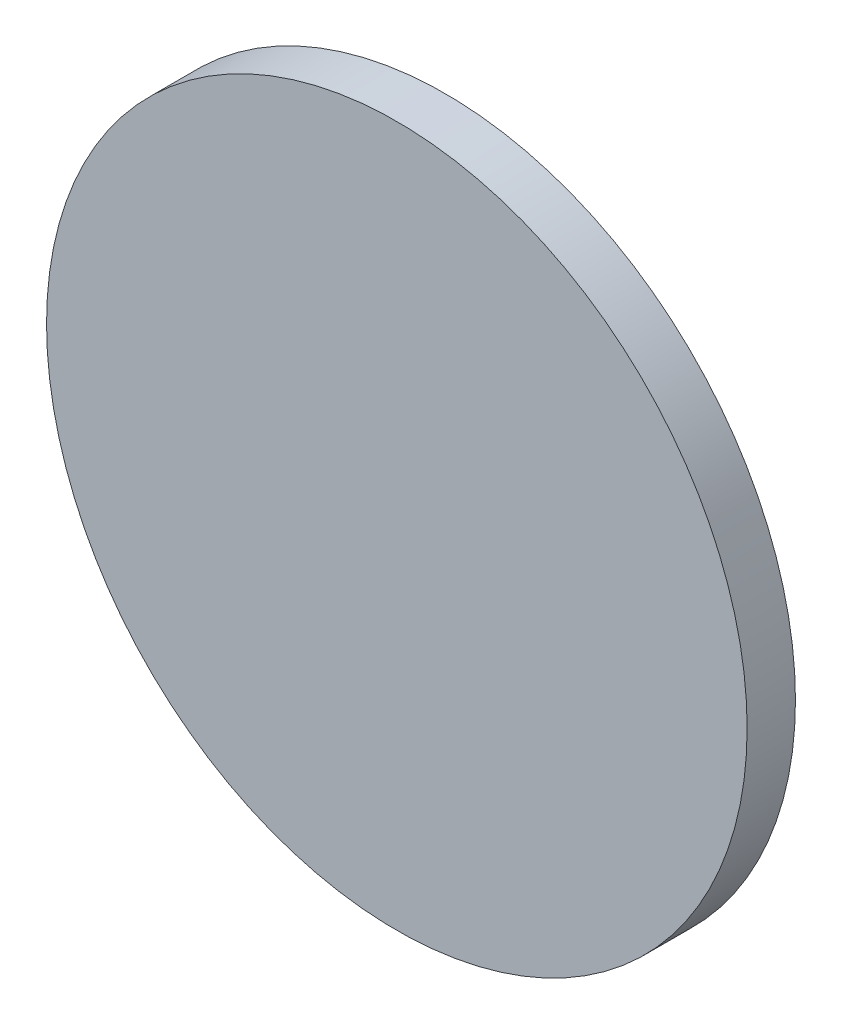
ISO-10303-21;
HEADER;
FILE_DESCRIPTION(('STEP AP214'),'2;1');
FILE_NAME('part.step','',(''),(''),'','','');
FILE_SCHEMA(('AUTOMOTIVE_DESIGN { 1 0 10303 214 1 1 1 1 }'));
ENDSEC;
DATA;
#1=APPLICATION_CONTEXT('core data for automotive mechanical design processes');
#2=APPLICATION_PROTOCOL_DEFINITION('international standard','automotive_design',2000,#1);
#3=PRODUCT_CONTEXT('',#1,'mechanical');
#4=PRODUCT('Part','Part','',(#3));
#5=PRODUCT_RELATED_PRODUCT_CATEGORY('part','',(#4));
#6=PRODUCT_DEFINITION_FORMATION('','',#4);
#7=PRODUCT_DEFINITION_CONTEXT('part definition',#1,'design');
#8=PRODUCT_DEFINITION('design','',#6,#7);
#9=PRODUCT_DEFINITION_SHAPE('','',#8);
#10=(LENGTH_UNIT() NAMED_UNIT(*) SI_UNIT(.MILLI.,.METRE.));
#11=(NAMED_UNIT(*) PLANE_ANGLE_UNIT() SI_UNIT($,.RADIAN.));
#12=(NAMED_UNIT(*) SI_UNIT($,.STERADIAN.) SOLID_ANGLE_UNIT());
#13=UNCERTAINTY_MEASURE_WITH_UNIT(LENGTH_MEASURE(1.E-05),#10,'distance_accuracy_value','');
#14=(GEOMETRIC_REPRESENTATION_CONTEXT(3) GLOBAL_UNCERTAINTY_ASSIGNED_CONTEXT((#13)) GLOBAL_UNIT_ASSIGNED_CONTEXT((#10,
#11,#12)) REPRESENTATION_CONTEXT('',''));
#15=CARTESIAN_POINT('',(0.,0.,0.));
#16=DIRECTION('',(0.,0.,1.));
#17=DIRECTION('',(1.,0.,0.));
#18=AXIS2_PLACEMENT_3D('',#15,#16,#17);
#19=CARTESIAN_POINT('',(0.,0.,2.));
#20=DIRECTION('',(0.,0.,-1.));
#21=DIRECTION('',(-1.,0.,0.));
#22=AXIS2_PLACEMENT_3D('',#19,#20,#21);
#23=CYLINDRICAL_SURFACE('',#22,14.5);
#24=CARTESIAN_POINT('',(0.,0.,2.));
#25=DIRECTION('',(0.,0.,1.));
#26=DIRECTION('',(1.,0.,0.));
#27=AXIS2_PLACEMENT_3D('',#24,#25,#26);
#28=CIRCLE('',#27,14.5);
#29=CARTESIAN_POINT('',(14.5,0.,2.));
#30=VERTEX_POINT('',#29);
#31=EDGE_CURVE('E10',#30,#30,#28,.T.);
#32=ORIENTED_EDGE('',*,*,#31,.F.);
#33=EDGE_LOOP('',(#32));
#34=FACE_BOUND('',#33,.T.);
#35=CARTESIAN_POINT('',(0.,0.,0.));
#36=DIRECTION('',(0.,0.,1.));
#37=DIRECTION('',(1.,0.,0.));
#38=AXIS2_PLACEMENT_3D('',#35,#36,#37);
#39=CIRCLE('',#38,14.5);
#40=CARTESIAN_POINT('',(14.5,0.,0.));
#41=VERTEX_POINT('',#40);
#42=EDGE_CURVE('E44',#41,#41,#39,.T.);
#43=ORIENTED_EDGE('',*,*,#42,.T.);
#44=EDGE_LOOP('',(#43));
#45=FACE_BOUND('',#44,.T.);
#46=ADVANCED_FACE('F41',(#34,#45),#23,.T.);
#47=CARTESIAN_POINT('',(0.,0.,2.));
#48=DIRECTION('',(0.,0.,1.));
#49=DIRECTION('',(1.,0.,0.));
#50=AXIS2_PLACEMENT_3D('',#47,#48,#49);
#51=PLANE('',#50);
#52=ORIENTED_EDGE('',*,*,#31,.T.);
#53=EDGE_LOOP('',(#52));
#54=FACE_BOUND('',#53,.T.);
#55=ADVANCED_FACE('F58',(#54),#51,.T.);
#56=CARTESIAN_POINT('',(0.,0.,0.));
#57=DIRECTION('',(0.,0.,1.));
#58=DIRECTION('',(1.,0.,0.));
#59=AXIS2_PLACEMENT_3D('',#56,#57,#58);
#60=PLANE('',#59);
#61=ORIENTED_EDGE('',*,*,#42,.F.);
#62=EDGE_LOOP('',(#61));
#63=FACE_BOUND('',#62,.T.);
#64=ADVANCED_FACE('F56',(#63),#60,.F.);
#65=CLOSED_SHELL('',(#46,#55,#64));
#66=MANIFOLD_SOLID_BREP('B2',#65);
#67=ADVANCED_BREP_SHAPE_REPRESENTATION('',(#18,#66),#14);
#68=SHAPE_DEFINITION_REPRESENTATION(#9,#67);
ENDSEC;
END-ISO-10303-21;
